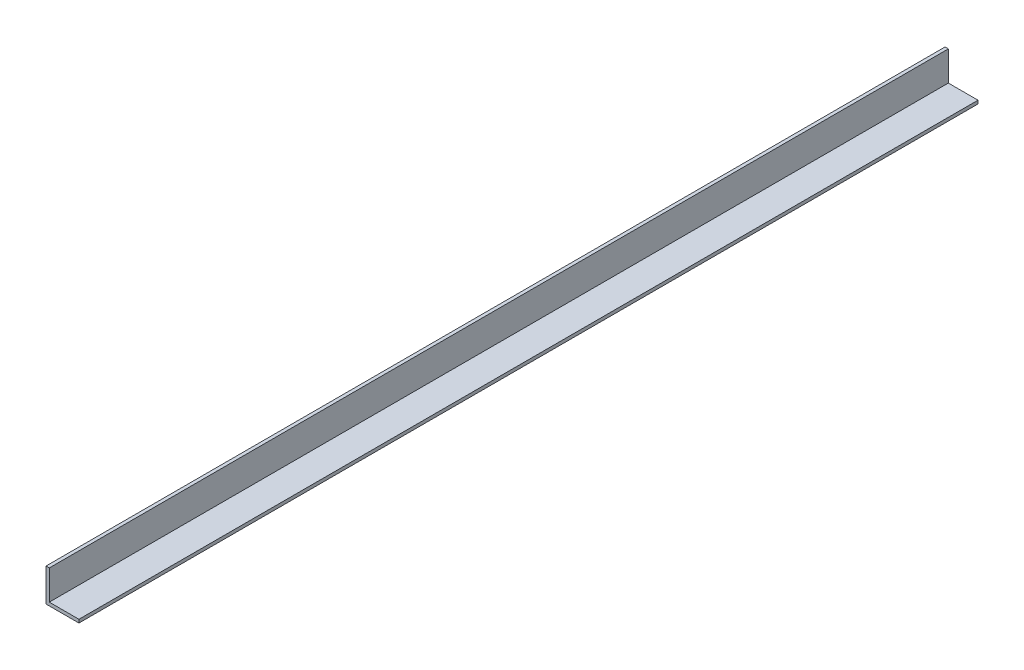
ISO-10303-21;
HEADER;
FILE_DESCRIPTION(('STEP AP214'),'2;1');
FILE_NAME('part.step','',(''),(''),'','','');
FILE_SCHEMA(('AUTOMOTIVE_DESIGN { 1 0 10303 214 1 1 1 1 }'));
ENDSEC;
DATA;
#1=APPLICATION_CONTEXT('core data for automotive mechanical design processes');
#2=APPLICATION_PROTOCOL_DEFINITION('international standard','automotive_design',2000,#1);
#3=PRODUCT_CONTEXT('',#1,'mechanical');
#4=PRODUCT('Part','Part','',(#3));
#5=PRODUCT_RELATED_PRODUCT_CATEGORY('part','',(#4));
#6=PRODUCT_DEFINITION_FORMATION('','',#4);
#7=PRODUCT_DEFINITION_CONTEXT('part definition',#1,'design');
#8=PRODUCT_DEFINITION('design','',#6,#7);
#9=PRODUCT_DEFINITION_SHAPE('','',#8);
#10=(LENGTH_UNIT() NAMED_UNIT(*) SI_UNIT(.MILLI.,.METRE.));
#11=(NAMED_UNIT(*) PLANE_ANGLE_UNIT() SI_UNIT($,.RADIAN.));
#12=(NAMED_UNIT(*) SI_UNIT($,.STERADIAN.) SOLID_ANGLE_UNIT());
#13=UNCERTAINTY_MEASURE_WITH_UNIT(LENGTH_MEASURE(1.E-05),#10,'distance_accuracy_value','');
#14=(GEOMETRIC_REPRESENTATION_CONTEXT(3) GLOBAL_UNCERTAINTY_ASSIGNED_CONTEXT((#13)) GLOBAL_UNIT_ASSIGNED_CONTEXT((#10,
#11,#12)) REPRESENTATION_CONTEXT('',''));
#15=CARTESIAN_POINT('',(0.,0.,0.));
#16=DIRECTION('',(0.,0.,1.));
#17=DIRECTION('',(1.,0.,0.));
#18=AXIS2_PLACEMENT_3D('',#15,#16,#17);
#19=CARTESIAN_POINT('',(-12.5003741853658,0.,-546.));
#20=DIRECTION('',(-1.,0.,0.));
#21=DIRECTION('',(0.,-1.,0.));
#22=AXIS2_PLACEMENT_3D('',#19,#20,#21);
#23=PLANE('',#22);
#24=DIRECTION('',(0.,-1.,0.));
#25=VECTOR('',#24,1.);
#26=CARTESIAN_POINT('',(-12.5003741853658,0.,0.));
#27=LINE('',#26,#25);
#28=CARTESIAN_POINT('',(-12.5003741853658,9.90243902439025,0.));
#29=VERTEX_POINT('',#28);
#30=CARTESIAN_POINT('',(-12.5003741853658,-8.09756097560975,0.));
#31=VERTEX_POINT('',#30);
#32=EDGE_CURVE('E130',#29,#31,#27,.T.);
#33=ORIENTED_EDGE('',*,*,#32,.T.);
#34=DIRECTION('',(0.,0.,1.));
#35=VECTOR('',#34,1.);
#36=CARTESIAN_POINT('',(-12.5003741853658,-8.09756097560975,-546.));
#37=LINE('',#36,#35);
#38=CARTESIAN_POINT('',(-12.5003741853658,-8.09756097560975,-546.));
#39=VERTEX_POINT('',#38);
#40=EDGE_CURVE('E11',#39,#31,#37,.T.);
#41=ORIENTED_EDGE('',*,*,#40,.F.);
#42=DIRECTION('',(0.,-1.,0.));
#43=VECTOR('',#42,1.);
#44=CARTESIAN_POINT('',(-12.5003741853658,0.,-546.));
#45=LINE('',#44,#43);
#46=CARTESIAN_POINT('',(-12.5003741853658,9.90243902439025,-546.));
#47=VERTEX_POINT('',#46);
#48=EDGE_CURVE('E60',#47,#39,#45,.T.);
#49=ORIENTED_EDGE('',*,*,#48,.F.);
#50=DIRECTION('',(0.,0.,1.));
#51=VECTOR('',#50,1.);
#52=CARTESIAN_POINT('',(-12.5003741853658,9.90243902439025,-546.));
#53=LINE('',#52,#51);
#54=EDGE_CURVE('E44',#47,#29,#53,.T.);
#55=ORIENTED_EDGE('',*,*,#54,.T.);
#56=EDGE_LOOP('',(#33,#41,#49,#55));
#57=FACE_BOUND('',#56,.T.);
#58=ADVANCED_FACE('F41',(#57),#23,.F.);
#59=CARTESIAN_POINT('',(0.,-8.09756097560975,-546.));
#60=DIRECTION('',(0.,1.,0.));
#61=DIRECTION('',(-1.,0.,0.));
#62=AXIS2_PLACEMENT_3D('',#59,#60,#61);
#63=PLANE('',#62);
#64=DIRECTION('',(-1.,0.,0.));
#65=VECTOR('',#64,1.);
#66=CARTESIAN_POINT('',(0.,-8.09756097560975,0.));
#67=LINE('',#66,#65);
#68=CARTESIAN_POINT('',(5.49962581463415,-8.09756097560975,0.));
#69=VERTEX_POINT('',#68);
#70=EDGE_CURVE('E145',#69,#31,#67,.T.);
#71=ORIENTED_EDGE('',*,*,#70,.F.);
#72=DIRECTION('',(0.,0.,1.));
#73=VECTOR('',#72,1.);
#74=CARTESIAN_POINT('',(5.49962581463415,-8.09756097560975,-546.));
#75=LINE('',#74,#73);
#76=CARTESIAN_POINT('',(5.49962581463415,-8.09756097560975,-546.));
#77=VERTEX_POINT('',#76);
#78=EDGE_CURVE('E51',#77,#69,#75,.T.);
#79=ORIENTED_EDGE('',*,*,#78,.F.);
#80=DIRECTION('',(-1.,0.,0.));
#81=VECTOR('',#80,1.);
#82=CARTESIAN_POINT('',(0.,-8.09756097560975,-546.));
#83=LINE('',#82,#81);
#84=EDGE_CURVE('E108',#77,#39,#83,.T.);
#85=ORIENTED_EDGE('',*,*,#84,.T.);
#86=ORIENTED_EDGE('',*,*,#40,.T.);
#87=EDGE_LOOP('',(#71,#79,#85,#86));
#88=FACE_BOUND('',#87,.T.);
#89=ADVANCED_FACE('F163',(#88),#63,.T.);
#90=CARTESIAN_POINT('',(5.49962581463415,0.,-546.));
#91=DIRECTION('',(-1.,0.,0.));
#92=DIRECTION('',(0.,-1.,0.));
#93=AXIS2_PLACEMENT_3D('',#90,#91,#92);
#94=PLANE('',#93);
#95=DIRECTION('',(0.,-1.,0.));
#96=VECTOR('',#95,1.);
#97=CARTESIAN_POINT('',(5.49962581463415,0.,0.));
#98=LINE('',#97,#96);
#99=CARTESIAN_POINT('',(5.49962581463415,-10.0975609756097,0.));
#100=VERTEX_POINT('',#99);
#101=EDGE_CURVE('E113',#69,#100,#98,.T.);
#102=ORIENTED_EDGE('',*,*,#101,.T.);
#103=DIRECTION('',(0.,0.,1.));
#104=VECTOR('',#103,1.);
#105=CARTESIAN_POINT('',(5.49962581463415,-10.0975609756097,-546.));
#106=LINE('',#105,#104);
#107=CARTESIAN_POINT('',(5.49962581463415,-10.0975609756097,-546.));
#108=VERTEX_POINT('',#107);
#109=EDGE_CURVE('E111',#108,#100,#106,.T.);
#110=ORIENTED_EDGE('',*,*,#109,.F.);
#111=DIRECTION('',(0.,-1.,0.));
#112=VECTOR('',#111,1.);
#113=CARTESIAN_POINT('',(5.49962581463415,0.,-546.));
#114=LINE('',#113,#112);
#115=EDGE_CURVE('E102',#77,#108,#114,.T.);
#116=ORIENTED_EDGE('',*,*,#115,.F.);
#117=ORIENTED_EDGE('',*,*,#78,.T.);
#118=EDGE_LOOP('',(#102,#110,#116,#117));
#119=FACE_BOUND('',#118,.T.);
#120=ADVANCED_FACE('F112',(#119),#94,.F.);
#121=CARTESIAN_POINT('',(0.,-10.0975609756097,-546.));
#122=DIRECTION('',(0.,-1.,0.));
#123=DIRECTION('',(0.,0.,-1.));
#124=AXIS2_PLACEMENT_3D('',#121,#122,#123);
#125=PLANE('',#124);
#126=DIRECTION('',(1.,0.,0.));
#127=VECTOR('',#126,1.);
#128=CARTESIAN_POINT('',(0.,-10.0975609756097,0.));
#129=LINE('',#128,#127);
#130=CARTESIAN_POINT('',(-14.5003741853658,-10.0975609756097,0.));
#131=VERTEX_POINT('',#130);
#132=EDGE_CURVE('E140',#131,#100,#129,.T.);
#133=ORIENTED_EDGE('',*,*,#132,.F.);
#134=DIRECTION('',(0.,0.,1.));
#135=VECTOR('',#134,1.);
#136=CARTESIAN_POINT('',(-14.5003741853658,-10.0975609756097,-546.));
#137=LINE('',#136,#135);
#138=CARTESIAN_POINT('',(-14.5003741853658,-10.0975609756097,-546.));
#139=VERTEX_POINT('',#138);
#140=EDGE_CURVE('E118',#139,#131,#137,.T.);
#141=ORIENTED_EDGE('',*,*,#140,.F.);
#142=DIRECTION('',(1.,0.,0.));
#143=VECTOR('',#142,1.);
#144=CARTESIAN_POINT('',(0.,-10.0975609756097,-546.));
#145=LINE('',#144,#143);
#146=EDGE_CURVE('E106',#139,#108,#145,.T.);
#147=ORIENTED_EDGE('',*,*,#146,.T.);
#148=ORIENTED_EDGE('',*,*,#109,.T.);
#149=EDGE_LOOP('',(#133,#141,#147,#148));
#150=FACE_BOUND('',#149,.T.);
#151=ADVANCED_FACE('F120',(#150),#125,.T.);
#152=CARTESIAN_POINT('',(-14.5003741853659,0.,-546.));
#153=DIRECTION('',(-1.,0.,0.));
#154=DIRECTION('',(0.,-1.,0.));
#155=AXIS2_PLACEMENT_3D('',#152,#153,#154);
#156=PLANE('',#155);
#157=DIRECTION('',(0.,-1.,0.));
#158=VECTOR('',#157,1.);
#159=CARTESIAN_POINT('',(-14.5003741853659,0.,0.));
#160=LINE('',#159,#158);
#161=CARTESIAN_POINT('',(-14.5003741853659,9.90243902439025,0.));
#162=VERTEX_POINT('',#161);
#163=EDGE_CURVE('E136',#162,#131,#160,.T.);
#164=ORIENTED_EDGE('',*,*,#163,.F.);
#165=DIRECTION('',(0.,0.,1.));
#166=VECTOR('',#165,1.);
#167=CARTESIAN_POINT('',(-14.5003741853659,9.90243902439025,-546.));
#168=LINE('',#167,#166);
#169=CARTESIAN_POINT('',(-14.5003741853659,9.90243902439025,-546.));
#170=VERTEX_POINT('',#169);
#171=EDGE_CURVE('E152',#170,#162,#168,.T.);
#172=ORIENTED_EDGE('',*,*,#171,.F.);
#173=DIRECTION('',(0.,-1.,0.));
#174=VECTOR('',#173,1.);
#175=CARTESIAN_POINT('',(-14.5003741853659,0.,-546.));
#176=LINE('',#175,#174);
#177=EDGE_CURVE('E122',#170,#139,#176,.T.);
#178=ORIENTED_EDGE('',*,*,#177,.T.);
#179=ORIENTED_EDGE('',*,*,#140,.T.);
#180=EDGE_LOOP('',(#164,#172,#178,#179));
#181=FACE_BOUND('',#180,.T.);
#182=ADVANCED_FACE('F176',(#181),#156,.T.);
#183=CARTESIAN_POINT('',(0.,9.90243902439025,-546.));
#184=DIRECTION('',(0.,-1.,0.));
#185=DIRECTION('',(1.,0.,0.));
#186=AXIS2_PLACEMENT_3D('',#183,#184,#185);
#187=PLANE('',#186);
#188=DIRECTION('',(1.,0.,0.));
#189=VECTOR('',#188,1.);
#190=CARTESIAN_POINT('',(0.,9.90243902439025,0.));
#191=LINE('',#190,#189);
#192=EDGE_CURVE('E133',#162,#29,#191,.T.);
#193=ORIENTED_EDGE('',*,*,#192,.T.);
#194=ORIENTED_EDGE('',*,*,#54,.F.);
#195=DIRECTION('',(1.,0.,0.));
#196=VECTOR('',#195,1.);
#197=CARTESIAN_POINT('',(0.,9.90243902439025,-546.));
#198=LINE('',#197,#196);
#199=EDGE_CURVE('E93',#170,#47,#198,.T.);
#200=ORIENTED_EDGE('',*,*,#199,.F.);
#201=ORIENTED_EDGE('',*,*,#171,.T.);
#202=EDGE_LOOP('',(#193,#194,#200,#201));
#203=FACE_BOUND('',#202,.T.);
#204=ADVANCED_FACE('F178',(#203),#187,.F.);
#205=CARTESIAN_POINT('',(0.,0.,-546.));
#206=DIRECTION('',(0.,0.,1.));
#207=DIRECTION('',(1.,0.,0.));
#208=AXIS2_PLACEMENT_3D('',#205,#206,#207);
#209=PLANE('',#208);
#210=ORIENTED_EDGE('',*,*,#48,.T.);
#211=ORIENTED_EDGE('',*,*,#84,.F.);
#212=ORIENTED_EDGE('',*,*,#115,.T.);
#213=ORIENTED_EDGE('',*,*,#146,.F.);
#214=ORIENTED_EDGE('',*,*,#177,.F.);
#215=ORIENTED_EDGE('',*,*,#199,.T.);
#216=EDGE_LOOP('',(#210,#211,#212,#213,#214,#215));
#217=FACE_BOUND('',#216,.T.);
#218=ADVANCED_FACE('F104',(#217),#209,.F.);
#219=CARTESIAN_POINT('',(0.,0.,0.));
#220=DIRECTION('',(0.,0.,1.));
#221=DIRECTION('',(1.,0.,0.));
#222=AXIS2_PLACEMENT_3D('',#219,#220,#221);
#223=PLANE('',#222);
#224=ORIENTED_EDGE('',*,*,#32,.F.);
#225=ORIENTED_EDGE('',*,*,#192,.F.);
#226=ORIENTED_EDGE('',*,*,#163,.T.);
#227=ORIENTED_EDGE('',*,*,#132,.T.);
#228=ORIENTED_EDGE('',*,*,#101,.F.);
#229=ORIENTED_EDGE('',*,*,#70,.T.);
#230=EDGE_LOOP('',(#224,#225,#226,#227,#228,#229));
#231=FACE_BOUND('',#230,.T.);
#232=ADVANCED_FACE('F161',(#231),#223,.T.);
#233=CLOSED_SHELL('',(#58,#89,#120,#151,#182,#204,#218,#232));
#234=MANIFOLD_SOLID_BREP('B2',#233);
#235=ADVANCED_BREP_SHAPE_REPRESENTATION('',(#18,#234),#14);
#236=SHAPE_DEFINITION_REPRESENTATION(#9,#235);
ENDSEC;
END-ISO-10303-21;
